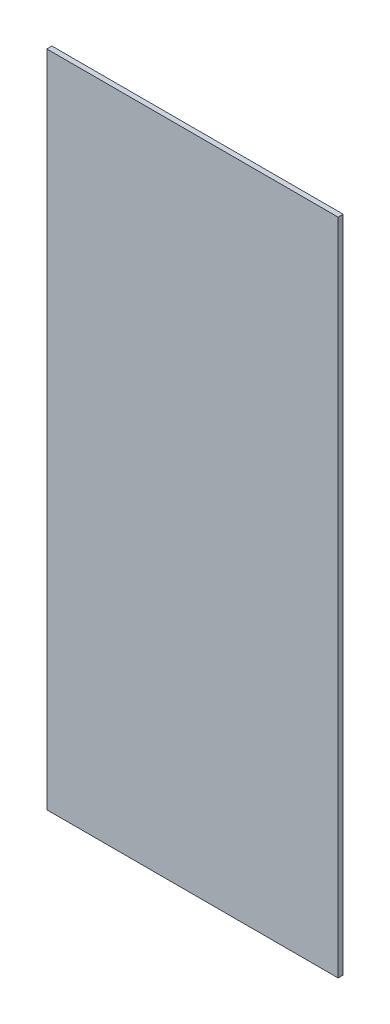
ISO-10303-21;
HEADER;
FILE_DESCRIPTION(('STEP AP214'),'2;1');
FILE_NAME('part.step','',(''),(''),'','','');
FILE_SCHEMA(('AUTOMOTIVE_DESIGN { 1 0 10303 214 1 1 1 1 }'));
ENDSEC;
DATA;
#1=APPLICATION_CONTEXT('core data for automotive mechanical design processes');
#2=APPLICATION_PROTOCOL_DEFINITION('international standard','automotive_design',2000,#1);
#3=PRODUCT_CONTEXT('',#1,'mechanical');
#4=PRODUCT('Part','Part','',(#3));
#5=PRODUCT_RELATED_PRODUCT_CATEGORY('part','',(#4));
#6=PRODUCT_DEFINITION_FORMATION('','',#4);
#7=PRODUCT_DEFINITION_CONTEXT('part definition',#1,'design');
#8=PRODUCT_DEFINITION('design','',#6,#7);
#9=PRODUCT_DEFINITION_SHAPE('','',#8);
#10=(LENGTH_UNIT() NAMED_UNIT(*) SI_UNIT(.MILLI.,.METRE.));
#11=(NAMED_UNIT(*) PLANE_ANGLE_UNIT() SI_UNIT($,.RADIAN.));
#12=(NAMED_UNIT(*) SI_UNIT($,.STERADIAN.) SOLID_ANGLE_UNIT());
#13=UNCERTAINTY_MEASURE_WITH_UNIT(LENGTH_MEASURE(1.E-05),#10,'distance_accuracy_value','');
#14=(GEOMETRIC_REPRESENTATION_CONTEXT(3) GLOBAL_UNCERTAINTY_ASSIGNED_CONTEXT((#13)) GLOBAL_UNIT_ASSIGNED_CONTEXT((#10,
#11,#12)) REPRESENTATION_CONTEXT('',''));
#15=CARTESIAN_POINT('',(0.,0.,0.));
#16=DIRECTION('',(0.,0.,1.));
#17=DIRECTION('',(1.,0.,0.));
#18=AXIS2_PLACEMENT_3D('',#15,#16,#17);
#19=CARTESIAN_POINT('',(287.5,650.25,10.));
#20=DIRECTION('',(-1.,0.,0.));
#21=DIRECTION('',(0.,-1.,0.));
#22=AXIS2_PLACEMENT_3D('',#19,#20,#21);
#23=PLANE('',#22);
#24=DIRECTION('',(0.,1.,0.));
#25=VECTOR('',#24,1.);
#26=CARTESIAN_POINT('',(287.5,650.25,0.));
#27=LINE('',#26,#25);
#28=CARTESIAN_POINT('',(287.5,-650.25,0.));
#29=VERTEX_POINT('',#28);
#30=CARTESIAN_POINT('',(287.5,650.25,0.));
#31=VERTEX_POINT('',#30);
#32=EDGE_CURVE('E98',#29,#31,#27,.T.);
#33=ORIENTED_EDGE('',*,*,#32,.T.);
#34=DIRECTION('',(0.,0.,-1.));
#35=VECTOR('',#34,1.);
#36=CARTESIAN_POINT('',(287.5,650.25,10.));
#37=LINE('',#36,#35);
#38=CARTESIAN_POINT('',(287.5,650.25,10.));
#39=VERTEX_POINT('',#38);
#40=EDGE_CURVE('E11',#39,#31,#37,.T.);
#41=ORIENTED_EDGE('',*,*,#40,.F.);
#42=DIRECTION('',(0.,1.,0.));
#43=VECTOR('',#42,1.);
#44=CARTESIAN_POINT('',(287.5,650.25,10.));
#45=LINE('',#44,#43);
#46=CARTESIAN_POINT('',(287.5,-650.25,10.));
#47=VERTEX_POINT('',#46);
#48=EDGE_CURVE('E86',#47,#39,#45,.T.);
#49=ORIENTED_EDGE('',*,*,#48,.F.);
#50=DIRECTION('',(0.,0.,-1.));
#51=VECTOR('',#50,1.);
#52=CARTESIAN_POINT('',(287.5,-650.25,10.));
#53=LINE('',#52,#51);
#54=EDGE_CURVE('E94',#47,#29,#53,.T.);
#55=ORIENTED_EDGE('',*,*,#54,.T.);
#56=EDGE_LOOP('',(#33,#41,#49,#55));
#57=FACE_BOUND('',#56,.T.);
#58=ADVANCED_FACE('F35',(#57),#23,.F.);
#59=CARTESIAN_POINT('',(-287.5,650.25,10.));
#60=DIRECTION('',(0.,-1.,0.));
#61=DIRECTION('',(0.,0.,-1.));
#62=AXIS2_PLACEMENT_3D('',#59,#60,#61);
#63=PLANE('',#62);
#64=DIRECTION('',(-1.,0.,0.));
#65=VECTOR('',#64,1.);
#66=CARTESIAN_POINT('',(-287.5,650.25,0.));
#67=LINE('',#66,#65);
#68=CARTESIAN_POINT('',(-287.5,650.25,0.));
#69=VERTEX_POINT('',#68);
#70=EDGE_CURVE('E90',#31,#69,#67,.T.);
#71=ORIENTED_EDGE('',*,*,#70,.T.);
#72=DIRECTION('',(0.,0.,-1.));
#73=VECTOR('',#72,1.);
#74=CARTESIAN_POINT('',(-287.5,650.25,10.));
#75=LINE('',#74,#73);
#76=CARTESIAN_POINT('',(-287.5,650.25,10.));
#77=VERTEX_POINT('',#76);
#78=EDGE_CURVE('E43',#77,#69,#75,.T.);
#79=ORIENTED_EDGE('',*,*,#78,.F.);
#80=DIRECTION('',(-1.,0.,0.));
#81=VECTOR('',#80,1.);
#82=CARTESIAN_POINT('',(-287.5,650.25,10.));
#83=LINE('',#82,#81);
#84=EDGE_CURVE('E81',#39,#77,#83,.T.);
#85=ORIENTED_EDGE('',*,*,#84,.F.);
#86=ORIENTED_EDGE('',*,*,#40,.T.);
#87=EDGE_LOOP('',(#71,#79,#85,#86));
#88=FACE_BOUND('',#87,.T.);
#89=ADVANCED_FACE('F89',(#88),#63,.F.);
#90=CARTESIAN_POINT('',(-287.5,650.25,10.));
#91=DIRECTION('',(1.,0.,0.));
#92=DIRECTION('',(0.,1.,0.));
#93=AXIS2_PLACEMENT_3D('',#90,#91,#92);
#94=PLANE('',#93);
#95=DIRECTION('',(0.,-1.,0.));
#96=VECTOR('',#95,1.);
#97=CARTESIAN_POINT('',(-287.5,650.25,0.));
#98=LINE('',#97,#96);
#99=CARTESIAN_POINT('',(-287.5,-650.25,0.));
#100=VERTEX_POINT('',#99);
#101=EDGE_CURVE('E68',#69,#100,#98,.T.);
#102=ORIENTED_EDGE('',*,*,#101,.T.);
#103=DIRECTION('',(0.,0.,-1.));
#104=VECTOR('',#103,1.);
#105=CARTESIAN_POINT('',(-287.5,-650.25,10.));
#106=LINE('',#105,#104);
#107=CARTESIAN_POINT('',(-287.5,-650.25,10.));
#108=VERTEX_POINT('',#107);
#109=EDGE_CURVE('E91',#108,#100,#106,.T.);
#110=ORIENTED_EDGE('',*,*,#109,.F.);
#111=DIRECTION('',(0.,-1.,0.));
#112=VECTOR('',#111,1.);
#113=CARTESIAN_POINT('',(-287.5,650.25,10.));
#114=LINE('',#113,#112);
#115=EDGE_CURVE('E84',#77,#108,#114,.T.);
#116=ORIENTED_EDGE('',*,*,#115,.F.);
#117=ORIENTED_EDGE('',*,*,#78,.T.);
#118=EDGE_LOOP('',(#102,#110,#116,#117));
#119=FACE_BOUND('',#118,.T.);
#120=ADVANCED_FACE('F92',(#119),#94,.F.);
#121=CARTESIAN_POINT('',(-287.5,-650.25,10.));
#122=DIRECTION('',(0.,1.,0.));
#123=DIRECTION('',(0.,0.,1.));
#124=AXIS2_PLACEMENT_3D('',#121,#122,#123);
#125=PLANE('',#124);
#126=DIRECTION('',(1.,0.,0.));
#127=VECTOR('',#126,1.);
#128=CARTESIAN_POINT('',(-287.5,-650.25,0.));
#129=LINE('',#128,#127);
#130=EDGE_CURVE('E74',#100,#29,#129,.T.);
#131=ORIENTED_EDGE('',*,*,#130,.T.);
#132=ORIENTED_EDGE('',*,*,#54,.F.);
#133=DIRECTION('',(1.,0.,0.));
#134=VECTOR('',#133,1.);
#135=CARTESIAN_POINT('',(-287.5,-650.25,10.));
#136=LINE('',#135,#134);
#137=EDGE_CURVE('E51',#108,#47,#136,.T.);
#138=ORIENTED_EDGE('',*,*,#137,.F.);
#139=ORIENTED_EDGE('',*,*,#109,.T.);
#140=EDGE_LOOP('',(#131,#132,#138,#139));
#141=FACE_BOUND('',#140,.T.);
#142=ADVANCED_FACE('F105',(#141),#125,.F.);
#143=CARTESIAN_POINT('',(0.,0.,10.));
#144=DIRECTION('',(0.,0.,1.));
#145=DIRECTION('',(1.,0.,0.));
#146=AXIS2_PLACEMENT_3D('',#143,#144,#145);
#147=PLANE('',#146);
#148=ORIENTED_EDGE('',*,*,#48,.T.);
#149=ORIENTED_EDGE('',*,*,#84,.T.);
#150=ORIENTED_EDGE('',*,*,#115,.T.);
#151=ORIENTED_EDGE('',*,*,#137,.T.);
#152=EDGE_LOOP('',(#148,#149,#150,#151));
#153=FACE_BOUND('',#152,.T.);
#154=ADVANCED_FACE('F82',(#153),#147,.T.);
#155=CARTESIAN_POINT('',(0.,0.,0.));
#156=DIRECTION('',(0.,0.,1.));
#157=DIRECTION('',(1.,0.,0.));
#158=AXIS2_PLACEMENT_3D('',#155,#156,#157);
#159=PLANE('',#158);
#160=ORIENTED_EDGE('',*,*,#32,.F.);
#161=ORIENTED_EDGE('',*,*,#130,.F.);
#162=ORIENTED_EDGE('',*,*,#101,.F.);
#163=ORIENTED_EDGE('',*,*,#70,.F.);
#164=EDGE_LOOP('',(#160,#161,#162,#163));
#165=FACE_BOUND('',#164,.T.);
#166=ADVANCED_FACE('F108',(#165),#159,.F.);
#167=CLOSED_SHELL('',(#58,#89,#120,#142,#154,#166));
#168=MANIFOLD_SOLID_BREP('B2',#167);
#169=ADVANCED_BREP_SHAPE_REPRESENTATION('',(#18,#168),#14);
#170=SHAPE_DEFINITION_REPRESENTATION(#9,#169);
ENDSEC;
END-ISO-10303-21;
